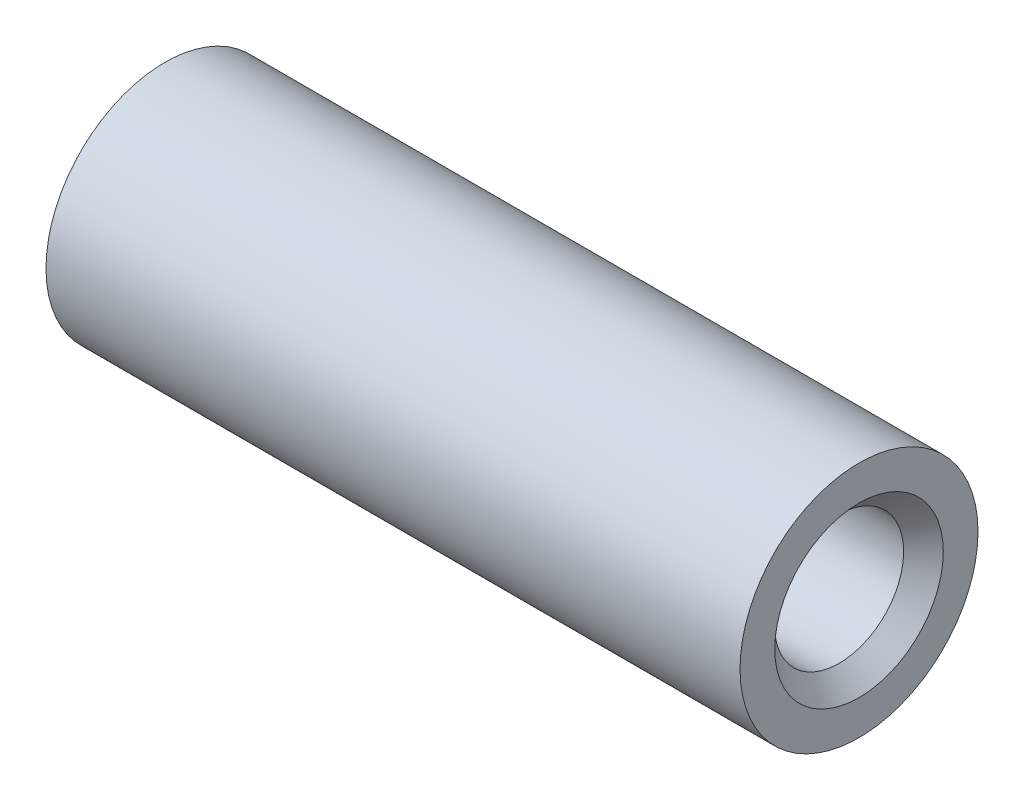
ISO-10303-21;
HEADER;
FILE_DESCRIPTION(('STEP AP214'),'2;1');
FILE_NAME('part.step','',(''),(''),'','','');
FILE_SCHEMA(('AUTOMOTIVE_DESIGN { 1 0 10303 214 1 1 1 1 }'));
ENDSEC;
DATA;
#1=APPLICATION_CONTEXT('core data for automotive mechanical design processes');
#2=APPLICATION_PROTOCOL_DEFINITION('international standard','automotive_design',2000,#1);
#3=PRODUCT_CONTEXT('',#1,'mechanical');
#4=PRODUCT('Part','Part','',(#3));
#5=PRODUCT_RELATED_PRODUCT_CATEGORY('part','',(#4));
#6=PRODUCT_DEFINITION_FORMATION('','',#4);
#7=PRODUCT_DEFINITION_CONTEXT('part definition',#1,'design');
#8=PRODUCT_DEFINITION('design','',#6,#7);
#9=PRODUCT_DEFINITION_SHAPE('','',#8);
#10=(LENGTH_UNIT() NAMED_UNIT(*) SI_UNIT(.MILLI.,.METRE.));
#11=(NAMED_UNIT(*) PLANE_ANGLE_UNIT() SI_UNIT($,.RADIAN.));
#12=(NAMED_UNIT(*) SI_UNIT($,.STERADIAN.) SOLID_ANGLE_UNIT());
#13=UNCERTAINTY_MEASURE_WITH_UNIT(LENGTH_MEASURE(1.E-05),#10,'distance_accuracy_value','');
#14=(GEOMETRIC_REPRESENTATION_CONTEXT(3) GLOBAL_UNCERTAINTY_ASSIGNED_CONTEXT((#13)) GLOBAL_UNIT_ASSIGNED_CONTEXT((#10,
#11,#12)) REPRESENTATION_CONTEXT('',''));
#15=CARTESIAN_POINT('',(0.,0.,0.));
#16=DIRECTION('',(0.,0.,1.));
#17=DIRECTION('',(1.,0.,0.));
#18=AXIS2_PLACEMENT_3D('',#15,#16,#17);
#19=CARTESIAN_POINT('',(35.,0.,0.));
#20=DIRECTION('',(1.,0.,0.));
#21=DIRECTION('',(0.,0.,-1.));
#22=AXIS2_PLACEMENT_3D('',#19,#20,#21);
#23=PLANE('',#22);
#24=CARTESIAN_POINT('',(35.,0.,0.));
#25=DIRECTION('',(1.,0.,0.));
#26=DIRECTION('',(0.,0.,-1.));
#27=AXIS2_PLACEMENT_3D('',#24,#25,#26);
#28=CIRCLE('',#27,4.25000000000001);
#29=CARTESIAN_POINT('',(35.,0.,-4.25000000000001));
#30=VERTEX_POINT('',#29);
#31=EDGE_CURVE('E10',#30,#30,#28,.F.);
#32=ORIENTED_EDGE('',*,*,#31,.T.);
#33=EDGE_LOOP('',(#32));
#34=FACE_BOUND('',#33,.T.);
#35=CARTESIAN_POINT('',(35.,0.,0.));
#36=DIRECTION('',(1.,0.,0.));
#37=DIRECTION('',(0.,0.,-1.));
#38=AXIS2_PLACEMENT_3D('',#35,#36,#37);
#39=CIRCLE('',#38,6.);
#40=CARTESIAN_POINT('',(35.,0.,-6.));
#41=VERTEX_POINT('',#40);
#42=EDGE_CURVE('E60',#41,#41,#39,.T.);
#43=ORIENTED_EDGE('',*,*,#42,.T.);
#44=EDGE_LOOP('',(#43));
#45=FACE_BOUND('',#44,.T.);
#46=ADVANCED_FACE('F39',(#34,#45),#23,.T.);
#47=CARTESIAN_POINT('',(0.,0.,0.));
#48=DIRECTION('',(1.,0.,0.));
#49=DIRECTION('',(0.,0.,-1.));
#50=AXIS2_PLACEMENT_3D('',#47,#48,#49);
#51=PLANE('',#50);
#52=CARTESIAN_POINT('',(0.,0.,0.));
#53=DIRECTION('',(1.,0.,0.));
#54=DIRECTION('',(0.,0.,-1.));
#55=AXIS2_PLACEMENT_3D('',#52,#53,#54);
#56=CIRCLE('',#55,4.25);
#57=CARTESIAN_POINT('',(0.,0.,-4.25));
#58=VERTEX_POINT('',#57);
#59=EDGE_CURVE('E55',#58,#58,#56,.T.);
#60=ORIENTED_EDGE('',*,*,#59,.T.);
#61=EDGE_LOOP('',(#60));
#62=FACE_BOUND('',#61,.T.);
#63=CARTESIAN_POINT('',(0.,0.,0.));
#64=DIRECTION('',(1.,0.,0.));
#65=DIRECTION('',(0.,0.,-1.));
#66=AXIS2_PLACEMENT_3D('',#63,#64,#65);
#67=CIRCLE('',#66,6.);
#68=CARTESIAN_POINT('',(0.,0.,-6.));
#69=VERTEX_POINT('',#68);
#70=EDGE_CURVE('E61',#69,#69,#67,.T.);
#71=ORIENTED_EDGE('',*,*,#70,.F.);
#72=EDGE_LOOP('',(#71));
#73=FACE_BOUND('',#72,.T.);
#74=ADVANCED_FACE('F72',(#62,#73),#51,.F.);
#75=CARTESIAN_POINT('',(35.,0.,0.));
#76=DIRECTION('',(-1.,0.,0.));
#77=DIRECTION('',(0.,0.,1.));
#78=AXIS2_PLACEMENT_3D('',#75,#76,#77);
#79=CYLINDRICAL_SURFACE('',#78,6.);
#80=ORIENTED_EDGE('',*,*,#42,.F.);
#81=EDGE_LOOP('',(#80));
#82=FACE_BOUND('',#81,.T.);
#83=ORIENTED_EDGE('',*,*,#70,.T.);
#84=EDGE_LOOP('',(#83));
#85=FACE_BOUND('',#84,.T.);
#86=ADVANCED_FACE('F68',(#82,#85),#79,.T.);
#87=CARTESIAN_POINT('',(35.,0.,0.));
#88=DIRECTION('',(-1.,0.,0.));
#89=DIRECTION('',(0.,0.,1.));
#90=AXIS2_PLACEMENT_3D('',#87,#88,#89);
#91=CYLINDRICAL_SURFACE('',#90,3.25);
#92=CARTESIAN_POINT('',(1.,0.,0.));
#93=DIRECTION('',(1.,0.,0.));
#94=DIRECTION('',(0.,0.,-1.));
#95=AXIS2_PLACEMENT_3D('',#92,#93,#94);
#96=CIRCLE('',#95,3.25);
#97=CARTESIAN_POINT('',(1.,0.,-3.25));
#98=VERTEX_POINT('',#97);
#99=EDGE_CURVE('E47',#98,#98,#96,.F.);
#100=ORIENTED_EDGE('',*,*,#99,.T.);
#101=EDGE_LOOP('',(#100));
#102=FACE_BOUND('',#101,.T.);
#103=CARTESIAN_POINT('',(34.,0.,0.));
#104=DIRECTION('',(1.,0.,0.));
#105=DIRECTION('',(0.,0.,-1.));
#106=AXIS2_PLACEMENT_3D('',#103,#104,#105);
#107=CIRCLE('',#106,3.25);
#108=CARTESIAN_POINT('',(34.,0.,-3.25));
#109=VERTEX_POINT('',#108);
#110=EDGE_CURVE('E51',#109,#109,#107,.T.);
#111=ORIENTED_EDGE('',*,*,#110,.T.);
#112=EDGE_LOOP('',(#111));
#113=FACE_BOUND('',#112,.T.);
#114=ADVANCED_FACE('F71',(#102,#113),#91,.F.);
#115=CARTESIAN_POINT('',(0.,0.,0.));
#116=DIRECTION('',(-1.,0.,0.));
#117=DIRECTION('',(0.,0.,1.));
#118=AXIS2_PLACEMENT_3D('',#115,#116,#117);
#119=CONICAL_SURFACE('',#118,4.25,0.785398163397446);
#120=ORIENTED_EDGE('',*,*,#99,.F.);
#121=EDGE_LOOP('',(#120));
#122=FACE_BOUND('',#121,.T.);
#123=ORIENTED_EDGE('',*,*,#59,.F.);
#124=EDGE_LOOP('',(#123));
#125=FACE_BOUND('',#124,.T.);
#126=ADVANCED_FACE('F86',(#122,#125),#119,.F.);
#127=CARTESIAN_POINT('',(34.,0.,0.));
#128=DIRECTION('',(1.,0.,0.));
#129=DIRECTION('',(0.,0.,-1.));
#130=AXIS2_PLACEMENT_3D('',#127,#128,#129);
#131=CONICAL_SURFACE('',#130,3.25,0.785398163397453);
#132=ORIENTED_EDGE('',*,*,#31,.F.);
#133=EDGE_LOOP('',(#132));
#134=FACE_BOUND('',#133,.T.);
#135=ORIENTED_EDGE('',*,*,#110,.F.);
#136=EDGE_LOOP('',(#135));
#137=FACE_BOUND('',#136,.T.);
#138=ADVANCED_FACE('F42',(#134,#137),#131,.F.);
#139=CLOSED_SHELL('',(#46,#74,#86,#114,#126,#138));
#140=MANIFOLD_SOLID_BREP('B2',#139);
#141=ADVANCED_BREP_SHAPE_REPRESENTATION('',(#18,#140),#14);
#142=SHAPE_DEFINITION_REPRESENTATION(#9,#141);
ENDSEC;
END-ISO-10303-21;
